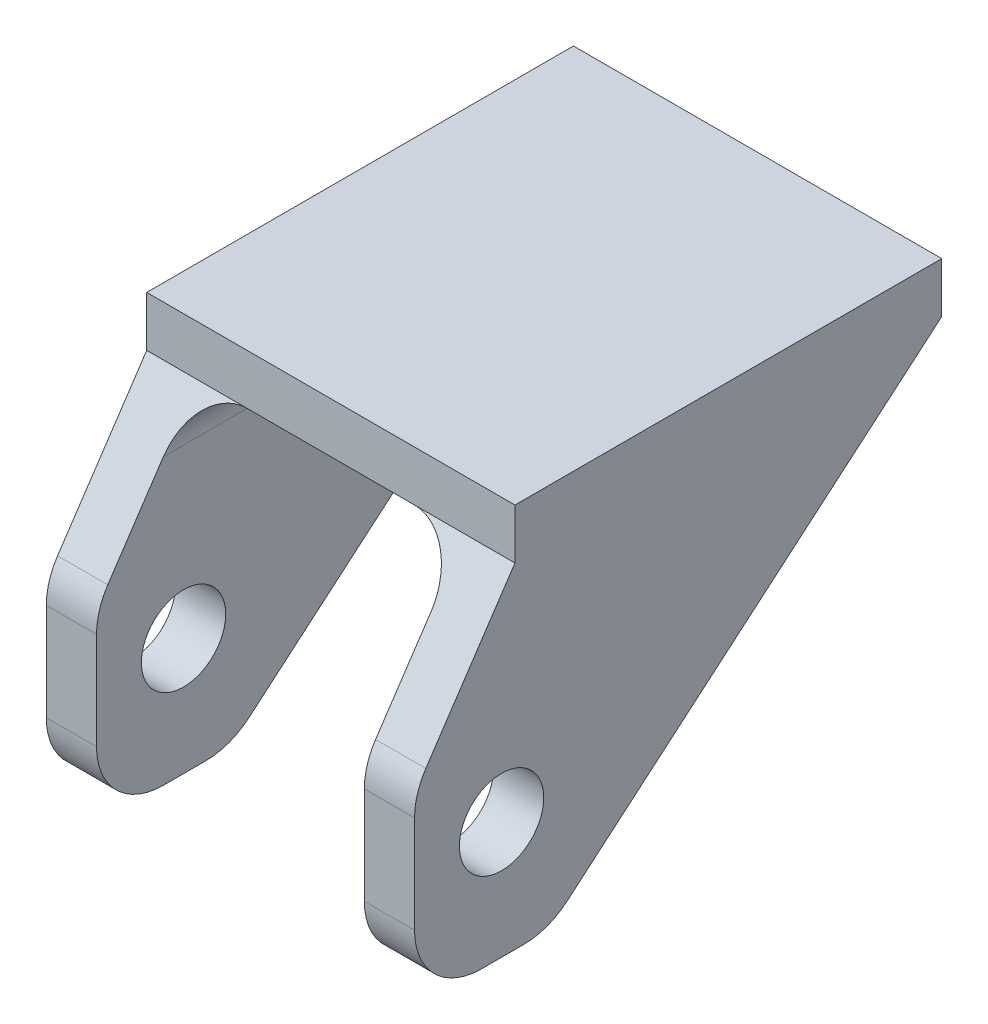
ISO-10303-21;
HEADER;
FILE_DESCRIPTION(('STEP AP214'),'2;1');
FILE_NAME('part.step','',(''),(''),'','','');
FILE_SCHEMA(('AUTOMOTIVE_DESIGN { 1 0 10303 214 1 1 1 1 }'));
ENDSEC;
DATA;
#1=APPLICATION_CONTEXT('core data for automotive mechanical design processes');
#2=APPLICATION_PROTOCOL_DEFINITION('international standard','automotive_design',2000,#1);
#3=PRODUCT_CONTEXT('',#1,'mechanical');
#4=PRODUCT('Part','Part','',(#3));
#5=PRODUCT_RELATED_PRODUCT_CATEGORY('part','',(#4));
#6=PRODUCT_DEFINITION_FORMATION('','',#4);
#7=PRODUCT_DEFINITION_CONTEXT('part definition',#1,'design');
#8=PRODUCT_DEFINITION('design','',#6,#7);
#9=PRODUCT_DEFINITION_SHAPE('','',#8);
#10=(LENGTH_UNIT() NAMED_UNIT(*) SI_UNIT(.MILLI.,.METRE.));
#11=(NAMED_UNIT(*) PLANE_ANGLE_UNIT() SI_UNIT($,.RADIAN.));
#12=(NAMED_UNIT(*) SI_UNIT($,.STERADIAN.) SOLID_ANGLE_UNIT());
#13=UNCERTAINTY_MEASURE_WITH_UNIT(LENGTH_MEASURE(1.E-05),#10,'distance_accuracy_value','');
#14=(GEOMETRIC_REPRESENTATION_CONTEXT(3) GLOBAL_UNCERTAINTY_ASSIGNED_CONTEXT((#13)) GLOBAL_UNIT_ASSIGNED_CONTEXT((#10,
#11,#12)) REPRESENTATION_CONTEXT('',''));
#15=CARTESIAN_POINT('',(0.,0.,0.));
#16=DIRECTION('',(0.,0.,1.));
#17=DIRECTION('',(1.,0.,0.));
#18=AXIS2_PLACEMENT_3D('',#15,#16,#17);
#19=CARTESIAN_POINT('',(0.,4.7625,25.));
#20=DIRECTION('',(0.,0.,1.));
#21=DIRECTION('',(1.,0.,0.));
#22=AXIS2_PLACEMENT_3D('',#19,#20,#21);
#23=PLANE('',#22);
#24=DIRECTION('',(0.,1.,0.));
#25=VECTOR('',#24,1.);
#26=CARTESIAN_POINT('',(-12.7,-31.75,25.));
#27=LINE('',#26,#25);
#28=CARTESIAN_POINT('',(-12.7,-25.4,25.));
#29=VERTEX_POINT('',#28);
#30=CARTESIAN_POINT('',(-12.7,-16.1746990921694,25.));
#31=VERTEX_POINT('',#30);
#32=EDGE_CURVE('E384',#29,#31,#27,.T.);
#33=ORIENTED_EDGE('',*,*,#32,.T.);
#34=DIRECTION('',(1.,0.,0.));
#35=VECTOR('',#34,1.);
#36=CARTESIAN_POINT('',(-17.4625,-16.1746990921694,25.));
#37=LINE('',#36,#35);
#38=CARTESIAN_POINT('',(-17.4625,-16.1746990921694,25.));
#39=VERTEX_POINT('',#38);
#40=EDGE_CURVE('E292',#31,#39,#37,.F.);
#41=ORIENTED_EDGE('',*,*,#40,.T.);
#42=DIRECTION('',(0.,-1.,0.));
#43=VECTOR('',#42,1.);
#44=CARTESIAN_POINT('',(-17.4625,4.7625,25.));
#45=LINE('',#44,#43);
#46=CARTESIAN_POINT('',(-17.4625,-25.4,25.));
#47=VERTEX_POINT('',#46);
#48=EDGE_CURVE('E210',#39,#47,#45,.T.);
#49=ORIENTED_EDGE('',*,*,#48,.T.);
#50=DIRECTION('',(-1.,0.,0.));
#51=VECTOR('',#50,1.);
#52=CARTESIAN_POINT('',(-12.7,-25.4,25.));
#53=LINE('',#52,#51);
#54=EDGE_CURVE('E289',#47,#29,#53,.F.);
#55=ORIENTED_EDGE('',*,*,#54,.T.);
#56=EDGE_LOOP('',(#33,#41,#49,#55));
#57=FACE_BOUND('',#56,.T.);
#58=ADVANCED_FACE('F41',(#57),#23,.T.);
#59=CARTESIAN_POINT('',(0.,0.,0.));
#60=DIRECTION('',(0.,1.,0.));
#61=DIRECTION('',(0.,0.,1.));
#62=AXIS2_PLACEMENT_3D('',#59,#60,#61);
#63=PLANE('',#62);
#64=DIRECTION('',(-1.,0.,0.));
#65=VECTOR('',#64,1.);
#66=CARTESIAN_POINT('',(0.,0.,-25.));
#67=LINE('',#66,#65);
#68=CARTESIAN_POINT('',(7.9375,0.,-25.));
#69=VERTEX_POINT('',#68);
#70=CARTESIAN_POINT('',(-7.9375,0.,-25.));
#71=VERTEX_POINT('',#70);
#72=EDGE_CURVE('E199',#69,#71,#67,.T.);
#73=ORIENTED_EDGE('',*,*,#72,.F.);
#74=DIRECTION('',(0.,0.,-1.));
#75=VECTOR('',#74,1.);
#76=CARTESIAN_POINT('',(7.9375,0.,15.475));
#77=LINE('',#76,#75);
#78=CARTESIAN_POINT('',(7.9375,0.,15.475));
#79=VERTEX_POINT('',#78);
#80=EDGE_CURVE('E314',#69,#79,#77,.F.);
#81=ORIENTED_EDGE('',*,*,#80,.T.);
#82=DIRECTION('',(1.,0.,0.));
#83=VECTOR('',#82,1.);
#84=CARTESIAN_POINT('',(-17.4625,0.,15.475));
#85=LINE('',#84,#83);
#86=CARTESIAN_POINT('',(-7.9375,0.,15.475));
#87=VERTEX_POINT('',#86);
#88=EDGE_CURVE('E758',#87,#79,#85,.T.);
#89=ORIENTED_EDGE('',*,*,#88,.F.);
#90=DIRECTION('',(0.,0.,-1.));
#91=VECTOR('',#90,1.);
#92=CARTESIAN_POINT('',(-7.9375,0.,0.));
#93=LINE('',#92,#91);
#94=EDGE_CURVE('E310',#87,#71,#93,.T.);
#95=ORIENTED_EDGE('',*,*,#94,.T.);
#96=EDGE_LOOP('',(#73,#81,#89,#95));
#97=FACE_BOUND('',#96,.T.);
#98=ADVANCED_FACE('F464',(#97),#63,.F.);
#99=CARTESIAN_POINT('',(0.,4.7625,-25.));
#100=DIRECTION('',(0.,0.,1.));
#101=DIRECTION('',(1.,0.,0.));
#102=AXIS2_PLACEMENT_3D('',#99,#100,#101);
#103=PLANE('',#102);
#104=DIRECTION('',(0.,-1.,0.));
#105=VECTOR('',#104,1.);
#106=CARTESIAN_POINT('',(17.4625,4.7625,-25.));
#107=LINE('',#106,#105);
#108=CARTESIAN_POINT('',(17.4625,4.7625,-25.));
#109=VERTEX_POINT('',#108);
#110=CARTESIAN_POINT('',(17.4625,0.,-25.));
#111=VERTEX_POINT('',#110);
#112=EDGE_CURVE('E397',#109,#111,#107,.T.);
#113=ORIENTED_EDGE('',*,*,#112,.T.);
#114=DIRECTION('',(1.,0.,0.));
#115=VECTOR('',#114,1.);
#116=CARTESIAN_POINT('',(-17.4625,0.,-25.));
#117=LINE('',#116,#115);
#118=EDGE_CURVE('E66',#69,#111,#117,.T.);
#119=ORIENTED_EDGE('',*,*,#118,.F.);
#120=ORIENTED_EDGE('',*,*,#72,.T.);
#121=CARTESIAN_POINT('',(-17.4625,0.,-25.));
#122=VERTEX_POINT('',#121);
#123=EDGE_CURVE('E82',#122,#71,#117,.T.);
#124=ORIENTED_EDGE('',*,*,#123,.F.);
#125=DIRECTION('',(0.,-1.,0.));
#126=VECTOR('',#125,1.);
#127=CARTESIAN_POINT('',(-17.4625,4.7625,-25.));
#128=LINE('',#127,#126);
#129=CARTESIAN_POINT('',(-17.4625,4.7625,-25.));
#130=VERTEX_POINT('',#129);
#131=EDGE_CURVE('E198',#130,#122,#128,.T.);
#132=ORIENTED_EDGE('',*,*,#131,.F.);
#133=DIRECTION('',(-1.,0.,0.));
#134=VECTOR('',#133,1.);
#135=CARTESIAN_POINT('',(0.,4.7625,-25.));
#136=LINE('',#135,#134);
#137=EDGE_CURVE('E388',#109,#130,#136,.T.);
#138=ORIENTED_EDGE('',*,*,#137,.F.);
#139=EDGE_LOOP('',(#113,#119,#120,#124,#132,#138));
#140=FACE_BOUND('',#139,.T.);
#141=ADVANCED_FACE('F196',(#140),#103,.F.);
#142=CARTESIAN_POINT('',(-17.4625,4.7625,0.));
#143=DIRECTION('',(1.,0.,0.));
#144=DIRECTION('',(0.,0.,-1.));
#145=AXIS2_PLACEMENT_3D('',#142,#143,#144);
#146=PLANE('',#145);
#147=CARTESIAN_POINT('',(-17.4625,-20.6375,16.745));
#148=DIRECTION('',(1.,0.,0.));
#149=DIRECTION('',(0.,0.,-1.));
#150=AXIS2_PLACEMENT_3D('',#147,#148,#149);
#151=CIRCLE('',#150,4.);
#152=CARTESIAN_POINT('',(-17.4625,-20.6375,12.745));
#153=VERTEX_POINT('',#152);
#154=EDGE_CURVE('E355',#153,#153,#151,.T.);
#155=ORIENTED_EDGE('',*,*,#154,.T.);
#156=EDGE_LOOP('',(#155));
#157=FACE_BOUND('',#156,.T.);
#158=DIRECTION('',(0.,-0.648181604007245,0.761485789904575));
#159=VECTOR('',#158,1.);
#160=CARTESIAN_POINT('',(-17.4625,-12.3395270182268,-10.5034847943351));
#161=LINE('',#160,#159);
#162=CARTESIAN_POINT('',(-17.4625,-30.2354347658941,10.5206839926881));
#163=VERTEX_POINT('',#162);
#164=EDGE_CURVE('E185',#122,#163,#161,.T.);
#165=ORIENTED_EDGE('',*,*,#164,.T.);
#166=CARTESIAN_POINT('',(-17.4625,-25.4,14.6366371781341));
#167=DIRECTION('',(1.,0.,0.));
#168=DIRECTION('',(0.,0.,-1.));
#169=AXIS2_PLACEMENT_3D('',#166,#167,#168);
#170=CIRCLE('',#169,6.35);
#171=CARTESIAN_POINT('',(-17.4625,-31.75,14.6366371781341));
#172=VERTEX_POINT('',#171);
#173=EDGE_CURVE('E253',#163,#172,#170,.F.);
#174=ORIENTED_EDGE('',*,*,#173,.T.);
#175=DIRECTION('',(0.,0.,1.));
#176=VECTOR('',#175,1.);
#177=CARTESIAN_POINT('',(-17.4625,-31.75,0.));
#178=LINE('',#177,#176);
#179=CARTESIAN_POINT('',(-17.4625,-31.75,18.65));
#180=VERTEX_POINT('',#179);
#181=EDGE_CURVE('E376',#172,#180,#178,.T.);
#182=ORIENTED_EDGE('',*,*,#181,.T.);
#183=CARTESIAN_POINT('',(-17.4625,-25.4,18.65));
#184=DIRECTION('',(1.,0.,0.));
#185=DIRECTION('',(0.,0.,-1.));
#186=AXIS2_PLACEMENT_3D('',#183,#184,#185);
#187=CIRCLE('',#186,6.35);
#188=EDGE_CURVE('E247',#180,#47,#187,.F.);
#189=ORIENTED_EDGE('',*,*,#188,.T.);
#190=ORIENTED_EDGE('',*,*,#48,.F.);
#191=CARTESIAN_POINT('',(-17.4625,-16.1746990921694,18.65));
#192=DIRECTION('',(1.,0.,0.));
#193=DIRECTION('',(0.,0.,-1.));
#194=AXIS2_PLACEMENT_3D('',#191,#192,#193);
#195=CIRCLE('',#194,6.35);
#196=CARTESIAN_POINT('',(-17.4625,-12.6455319689373,23.9289657525218));
#197=VERTEX_POINT('',#196);
#198=EDGE_CURVE('E250',#39,#197,#195,.F.);
#199=ORIENTED_EDGE('',*,*,#198,.T.);
#200=DIRECTION('',(0.,0.831333189373505,-0.555774350115293));
#201=VECTOR('',#200,1.);
#202=CARTESIAN_POINT('',(-17.4625,7.14997093575034,10.695002640392));
#203=LINE('',#202,#201);
#204=CARTESIAN_POINT('',(-17.4625,0.,15.475));
#205=VERTEX_POINT('',#204);
#206=EDGE_CURVE('E424',#197,#205,#203,.T.);
#207=ORIENTED_EDGE('',*,*,#206,.T.);
#208=DIRECTION('',(0.,1.,0.));
#209=VECTOR('',#208,1.);
#210=CARTESIAN_POINT('',(-17.4625,0.,15.475));
#211=LINE('',#210,#209);
#212=CARTESIAN_POINT('',(-17.4625,4.7625,15.475));
#213=VERTEX_POINT('',#212);
#214=EDGE_CURVE('E428',#205,#213,#211,.T.);
#215=ORIENTED_EDGE('',*,*,#214,.T.);
#216=DIRECTION('',(0.,0.,1.));
#217=VECTOR('',#216,1.);
#218=CARTESIAN_POINT('',(-17.4625,4.7625,0.));
#219=LINE('',#218,#217);
#220=EDGE_CURVE('E206',#130,#213,#219,.T.);
#221=ORIENTED_EDGE('',*,*,#220,.F.);
#222=ORIENTED_EDGE('',*,*,#131,.T.);
#223=EDGE_LOOP('',(#165,#174,#182,#189,#190,#199,#207,#215,#221,#222));
#224=FACE_BOUND('',#223,.T.);
#225=ADVANCED_FACE('F203',(#157,#224),#146,.F.);
#226=DIRECTION('',(0.,-1.,0.));
#227=VECTOR('',#226,1.);
#228=CARTESIAN_POINT('',(17.4625,4.7625,25.));
#229=LINE('',#228,#227);
#230=CARTESIAN_POINT('',(17.4625,-16.1746990921694,25.));
#231=VERTEX_POINT('',#230);
#232=CARTESIAN_POINT('',(17.4625,-25.4,25.));
#233=VERTEX_POINT('',#232);
#234=EDGE_CURVE('E218',#231,#233,#229,.T.);
#235=ORIENTED_EDGE('',*,*,#234,.F.);
#236=DIRECTION('',(1.,0.,0.));
#237=VECTOR('',#236,1.);
#238=CARTESIAN_POINT('',(12.7,-16.1746990921694,25.));
#239=LINE('',#238,#237);
#240=CARTESIAN_POINT('',(12.7,-16.1746990921694,25.));
#241=VERTEX_POINT('',#240);
#242=EDGE_CURVE('E303',#231,#241,#239,.F.);
#243=ORIENTED_EDGE('',*,*,#242,.T.);
#244=DIRECTION('',(0.,1.,0.));
#245=VECTOR('',#244,1.);
#246=CARTESIAN_POINT('',(12.7,-31.75,25.));
#247=LINE('',#246,#245);
#248=CARTESIAN_POINT('',(12.7,-25.4,25.));
#249=VERTEX_POINT('',#248);
#250=EDGE_CURVE('E373',#249,#241,#247,.T.);
#251=ORIENTED_EDGE('',*,*,#250,.F.);
#252=DIRECTION('',(1.,0.,0.));
#253=VECTOR('',#252,1.);
#254=CARTESIAN_POINT('',(17.4625,-25.4,25.));
#255=LINE('',#254,#253);
#256=EDGE_CURVE('E299',#249,#233,#255,.T.);
#257=ORIENTED_EDGE('',*,*,#256,.T.);
#258=EDGE_LOOP('',(#235,#243,#251,#257));
#259=FACE_BOUND('',#258,.T.);
#260=ADVANCED_FACE('F411',(#259),#23,.T.);
#261=CARTESIAN_POINT('',(17.4625,4.7625,0.));
#262=DIRECTION('',(1.,0.,0.));
#263=DIRECTION('',(0.,0.,-1.));
#264=AXIS2_PLACEMENT_3D('',#261,#262,#263);
#265=PLANE('',#264);
#266=DIRECTION('',(0.,0.,1.));
#267=VECTOR('',#266,1.);
#268=CARTESIAN_POINT('',(17.4625,-31.75,0.));
#269=LINE('',#268,#267);
#270=CARTESIAN_POINT('',(17.4625,-31.75,14.6366371781341));
#271=VERTEX_POINT('',#270);
#272=CARTESIAN_POINT('',(17.4625,-31.75,18.65));
#273=VERTEX_POINT('',#272);
#274=EDGE_CURVE('E365',#271,#273,#269,.T.);
#275=ORIENTED_EDGE('',*,*,#274,.F.);
#276=CARTESIAN_POINT('',(17.4625,-25.4,14.6366371781341));
#277=DIRECTION('',(1.,0.,0.));
#278=DIRECTION('',(0.,0.,-1.));
#279=AXIS2_PLACEMENT_3D('',#276,#277,#278);
#280=CIRCLE('',#279,6.35);
#281=CARTESIAN_POINT('',(17.4625,-30.2354347658941,10.5206839926881));
#282=VERTEX_POINT('',#281);
#283=EDGE_CURVE('E269',#271,#282,#280,.T.);
#284=ORIENTED_EDGE('',*,*,#283,.T.);
#285=DIRECTION('',(0.,-0.648181604007245,0.761485789904575));
#286=VECTOR('',#285,1.);
#287=CARTESIAN_POINT('',(17.4625,-12.3395270182268,-10.5034847943351));
#288=LINE('',#287,#286);
#289=EDGE_CURVE('E193',#111,#282,#288,.T.);
#290=ORIENTED_EDGE('',*,*,#289,.F.);
#291=ORIENTED_EDGE('',*,*,#112,.F.);
#292=DIRECTION('',(0.,0.,1.));
#293=VECTOR('',#292,1.);
#294=CARTESIAN_POINT('',(17.4625,4.7625,0.));
#295=LINE('',#294,#293);
#296=CARTESIAN_POINT('',(17.4625,4.7625,15.475));
#297=VERTEX_POINT('',#296);
#298=EDGE_CURVE('E393',#109,#297,#295,.T.);
#299=ORIENTED_EDGE('',*,*,#298,.T.);
#300=DIRECTION('',(0.,1.,0.));
#301=VECTOR('',#300,1.);
#302=CARTESIAN_POINT('',(17.4625,0.,15.475));
#303=LINE('',#302,#301);
#304=CARTESIAN_POINT('',(17.4625,0.,15.475));
#305=VERTEX_POINT('',#304);
#306=EDGE_CURVE('E418',#305,#297,#303,.T.);
#307=ORIENTED_EDGE('',*,*,#306,.F.);
#308=DIRECTION('',(0.,0.831333189373505,-0.555774350115293));
#309=VECTOR('',#308,1.);
#310=CARTESIAN_POINT('',(17.4625,7.14997093575034,10.695002640392));
#311=LINE('',#310,#309);
#312=CARTESIAN_POINT('',(17.4625,-12.6455319689373,23.9289657525218));
#313=VERTEX_POINT('',#312);
#314=EDGE_CURVE('E416',#313,#305,#311,.T.);
#315=ORIENTED_EDGE('',*,*,#314,.F.);
#316=CARTESIAN_POINT('',(17.4625,-16.1746990921694,18.65));
#317=DIRECTION('',(1.,0.,0.));
#318=DIRECTION('',(0.,0.,-1.));
#319=AXIS2_PLACEMENT_3D('',#316,#317,#318);
#320=CIRCLE('',#319,6.35);
#321=EDGE_CURVE('E266',#313,#231,#320,.T.);
#322=ORIENTED_EDGE('',*,*,#321,.T.);
#323=ORIENTED_EDGE('',*,*,#234,.T.);
#324=CARTESIAN_POINT('',(17.4625,-25.4,18.65));
#325=DIRECTION('',(1.,0.,0.));
#326=DIRECTION('',(0.,0.,-1.));
#327=AXIS2_PLACEMENT_3D('',#324,#325,#326);
#328=CIRCLE('',#327,6.35);
#329=EDGE_CURVE('E263',#233,#273,#328,.T.);
#330=ORIENTED_EDGE('',*,*,#329,.T.);
#331=EDGE_LOOP('',(#275,#284,#290,#291,#299,#307,#315,#322,#323,#330));
#332=FACE_BOUND('',#331,.T.);
#333=CARTESIAN_POINT('',(17.4625,-20.6375,16.745));
#334=DIRECTION('',(1.,0.,0.));
#335=DIRECTION('',(0.,0.,-1.));
#336=AXIS2_PLACEMENT_3D('',#333,#334,#335);
#337=CIRCLE('',#336,4.);
#338=CARTESIAN_POINT('',(17.4625,-20.6375,12.745));
#339=VERTEX_POINT('',#338);
#340=EDGE_CURVE('E432',#339,#339,#337,.T.);
#341=ORIENTED_EDGE('',*,*,#340,.F.);
#342=EDGE_LOOP('',(#341));
#343=FACE_BOUND('',#342,.T.);
#344=ADVANCED_FACE('F406',(#332,#343),#265,.T.);
#345=CARTESIAN_POINT('',(0.,4.7625,0.));
#346=DIRECTION('',(0.,1.,0.));
#347=DIRECTION('',(0.,0.,1.));
#348=AXIS2_PLACEMENT_3D('',#345,#346,#347);
#349=PLANE('',#348);
#350=DIRECTION('',(1.,0.,0.));
#351=VECTOR('',#350,1.);
#352=CARTESIAN_POINT('',(-17.4625,4.7625,15.475));
#353=LINE('',#352,#351);
#354=EDGE_CURVE('E435',#213,#297,#353,.T.);
#355=ORIENTED_EDGE('',*,*,#354,.T.);
#356=ORIENTED_EDGE('',*,*,#298,.F.);
#357=ORIENTED_EDGE('',*,*,#137,.T.);
#358=ORIENTED_EDGE('',*,*,#220,.T.);
#359=EDGE_LOOP('',(#355,#356,#357,#358));
#360=FACE_BOUND('',#359,.T.);
#361=ADVANCED_FACE('F479',(#360),#349,.T.);
#362=CARTESIAN_POINT('',(-12.7,-31.75,0.));
#363=DIRECTION('',(1.,0.,0.));
#364=DIRECTION('',(0.,0.,-1.));
#365=AXIS2_PLACEMENT_3D('',#362,#363,#364);
#366=PLANE('',#365);
#367=DIRECTION('',(0.,-0.648181604007245,0.761485789904575));
#368=VECTOR('',#367,1.);
#369=CARTESIAN_POINT('',(-12.7,-25.6789527070324,5.16771451881289));
#370=LINE('',#369,#368);
#371=CARTESIAN_POINT('',(-12.7,-4.76249999999999,-19.405));
#372=VERTEX_POINT('',#371);
#373=CARTESIAN_POINT('',(-12.7,-30.235434765894,10.5206839926881));
#374=VERTEX_POINT('',#373);
#375=EDGE_CURVE('E226',#372,#374,#370,.T.);
#376=ORIENTED_EDGE('',*,*,#375,.F.);
#377=DIRECTION('',(0.,0.,-1.));
#378=VECTOR('',#377,1.);
#379=CARTESIAN_POINT('',(-12.7,-4.7625,0.));
#380=LINE('',#379,#378);
#381=CARTESIAN_POINT('',(-12.7,-4.7625,18.6588923024579));
#382=VERTEX_POINT('',#381);
#383=EDGE_CURVE('E318',#372,#382,#380,.F.);
#384=ORIENTED_EDGE('',*,*,#383,.T.);
#385=DIRECTION('',(0.,0.831333189373505,-0.555774350115293));
#386=VECTOR('',#385,1.);
#387=CARTESIAN_POINT('',(-12.7,-14.7929262424368,25.3645714423353));
#388=LINE('',#387,#386);
#389=CARTESIAN_POINT('',(-12.7,-12.6455319689373,23.9289657525218));
#390=VERTEX_POINT('',#389);
#391=EDGE_CURVE('E361',#390,#382,#388,.T.);
#392=ORIENTED_EDGE('',*,*,#391,.F.);
#393=CARTESIAN_POINT('',(-12.7,-16.1746990921694,18.65));
#394=DIRECTION('',(1.,0.,0.));
#395=DIRECTION('',(0.,0.,-1.));
#396=AXIS2_PLACEMENT_3D('',#393,#394,#395);
#397=CIRCLE('',#396,6.35);
#398=EDGE_CURVE('E238',#390,#31,#397,.T.);
#399=ORIENTED_EDGE('',*,*,#398,.T.);
#400=ORIENTED_EDGE('',*,*,#32,.F.);
#401=CARTESIAN_POINT('',(-12.7,-25.4,18.65));
#402=DIRECTION('',(1.,0.,0.));
#403=DIRECTION('',(0.,0.,-1.));
#404=AXIS2_PLACEMENT_3D('',#401,#402,#403);
#405=CIRCLE('',#404,6.35);
#406=CARTESIAN_POINT('',(-12.7,-31.75,18.65));
#407=VERTEX_POINT('',#406);
#408=EDGE_CURVE('E235',#29,#407,#405,.T.);
#409=ORIENTED_EDGE('',*,*,#408,.T.);
#410=DIRECTION('',(0.,0.,-1.));
#411=VECTOR('',#410,1.);
#412=CARTESIAN_POINT('',(-12.7,-31.75,0.));
#413=LINE('',#412,#411);
#414=CARTESIAN_POINT('',(-12.7,-31.75,14.6366371781341));
#415=VERTEX_POINT('',#414);
#416=EDGE_CURVE('E380',#407,#415,#413,.T.);
#417=ORIENTED_EDGE('',*,*,#416,.T.);
#418=CARTESIAN_POINT('',(-12.7,-25.4,14.6366371781341));
#419=DIRECTION('',(1.,0.,0.));
#420=DIRECTION('',(0.,0.,-1.));
#421=AXIS2_PLACEMENT_3D('',#418,#419,#420);
#422=CIRCLE('',#421,6.35);
#423=EDGE_CURVE('E241',#415,#374,#422,.T.);
#424=ORIENTED_EDGE('',*,*,#423,.T.);
#425=EDGE_LOOP('',(#376,#384,#392,#399,#400,#409,#417,#424));
#426=FACE_BOUND('',#425,.T.);
#427=CARTESIAN_POINT('',(-12.7,-20.6375,16.745));
#428=DIRECTION('',(1.,0.,0.));
#429=DIRECTION('',(0.,0.,-1.));
#430=AXIS2_PLACEMENT_3D('',#427,#428,#429);
#431=CIRCLE('',#430,4.);
#432=CARTESIAN_POINT('',(-12.7,-20.6375,12.745));
#433=VERTEX_POINT('',#432);
#434=EDGE_CURVE('E225',#433,#433,#431,.T.);
#435=ORIENTED_EDGE('',*,*,#434,.F.);
#436=EDGE_LOOP('',(#435));
#437=FACE_BOUND('',#436,.T.);
#438=ADVANCED_FACE('F517',(#426,#437),#366,.T.);
#439=CARTESIAN_POINT('',(0.,-31.75,0.));
#440=DIRECTION('',(0.,1.,0.));
#441=DIRECTION('',(0.,0.,1.));
#442=AXIS2_PLACEMENT_3D('',#439,#440,#441);
#443=PLANE('',#442);
#444=ORIENTED_EDGE('',*,*,#181,.F.);
#445=DIRECTION('',(1.,0.,0.));
#446=VECTOR('',#445,1.);
#447=CARTESIAN_POINT('',(0.,-31.75,14.6366371781341));
#448=LINE('',#447,#446);
#449=EDGE_CURVE('E231',#172,#415,#448,.T.);
#450=ORIENTED_EDGE('',*,*,#449,.T.);
#451=ORIENTED_EDGE('',*,*,#416,.F.);
#452=DIRECTION('',(-1.,0.,0.));
#453=VECTOR('',#452,1.);
#454=CARTESIAN_POINT('',(-17.4625,-31.75,18.65));
#455=LINE('',#454,#453);
#456=EDGE_CURVE('E215',#407,#180,#455,.T.);
#457=ORIENTED_EDGE('',*,*,#456,.T.);
#458=EDGE_LOOP('',(#444,#450,#451,#457));
#459=FACE_BOUND('',#458,.T.);
#460=ADVANCED_FACE('F524',(#459),#443,.F.);
#461=CARTESIAN_POINT('',(12.7,-31.75,0.));
#462=DIRECTION('',(1.,0.,0.));
#463=DIRECTION('',(0.,0.,-1.));
#464=AXIS2_PLACEMENT_3D('',#461,#462,#463);
#465=PLANE('',#464);
#466=CARTESIAN_POINT('',(12.7,-20.6375,16.745));
#467=DIRECTION('',(1.,0.,0.));
#468=DIRECTION('',(0.,0.,-1.));
#469=AXIS2_PLACEMENT_3D('',#466,#467,#468);
#470=CIRCLE('',#469,4.);
#471=CARTESIAN_POINT('',(12.7,-20.6375,12.745));
#472=VERTEX_POINT('',#471);
#473=EDGE_CURVE('E222',#472,#472,#470,.T.);
#474=ORIENTED_EDGE('',*,*,#473,.T.);
#475=EDGE_LOOP('',(#474));
#476=FACE_BOUND('',#475,.T.);
#477=DIRECTION('',(0.,0.831333189373505,-0.555774350115293));
#478=VECTOR('',#477,1.);
#479=CARTESIAN_POINT('',(12.7,-14.7929262424368,25.3645714423353));
#480=LINE('',#479,#478);
#481=CARTESIAN_POINT('',(12.7,-12.6455319689373,23.9289657525218));
#482=VERTEX_POINT('',#481);
#483=CARTESIAN_POINT('',(12.7,-4.7625,18.6588923024579));
#484=VERTEX_POINT('',#483);
#485=EDGE_CURVE('E209',#482,#484,#480,.T.);
#486=ORIENTED_EDGE('',*,*,#485,.T.);
#487=DIRECTION('',(0.,0.,-1.));
#488=VECTOR('',#487,1.);
#489=CARTESIAN_POINT('',(12.7,-4.7625,-25.));
#490=LINE('',#489,#488);
#491=CARTESIAN_POINT('',(12.7,-4.76249999999999,-19.405));
#492=VERTEX_POINT('',#491);
#493=EDGE_CURVE('E306',#484,#492,#490,.T.);
#494=ORIENTED_EDGE('',*,*,#493,.T.);
#495=DIRECTION('',(0.,-0.648181604007245,0.761485789904575));
#496=VECTOR('',#495,1.);
#497=CARTESIAN_POINT('',(12.7,-25.6789527070324,5.16771451881289));
#498=LINE('',#497,#496);
#499=CARTESIAN_POINT('',(12.7,-30.235434765894,10.5206839926881));
#500=VERTEX_POINT('',#499);
#501=EDGE_CURVE('E201',#492,#500,#498,.T.);
#502=ORIENTED_EDGE('',*,*,#501,.T.);
#503=CARTESIAN_POINT('',(12.7,-25.4,14.6366371781341));
#504=DIRECTION('',(1.,0.,0.));
#505=DIRECTION('',(0.,0.,-1.));
#506=AXIS2_PLACEMENT_3D('',#503,#504,#505);
#507=CIRCLE('',#506,6.35);
#508=CARTESIAN_POINT('',(12.7,-31.75,14.6366371781341));
#509=VERTEX_POINT('',#508);
#510=EDGE_CURVE('E282',#500,#509,#507,.F.);
#511=ORIENTED_EDGE('',*,*,#510,.T.);
#512=DIRECTION('',(0.,0.,-1.));
#513=VECTOR('',#512,1.);
#514=CARTESIAN_POINT('',(12.7,-31.75,0.));
#515=LINE('',#514,#513);
#516=CARTESIAN_POINT('',(12.7,-31.75,18.65));
#517=VERTEX_POINT('',#516);
#518=EDGE_CURVE('E369',#517,#509,#515,.T.);
#519=ORIENTED_EDGE('',*,*,#518,.F.);
#520=CARTESIAN_POINT('',(12.7,-25.4,18.65));
#521=DIRECTION('',(1.,0.,0.));
#522=DIRECTION('',(0.,0.,-1.));
#523=AXIS2_PLACEMENT_3D('',#520,#521,#522);
#524=CIRCLE('',#523,6.35);
#525=EDGE_CURVE('E276',#517,#249,#524,.F.);
#526=ORIENTED_EDGE('',*,*,#525,.T.);
#527=ORIENTED_EDGE('',*,*,#250,.T.);
#528=CARTESIAN_POINT('',(12.7,-16.1746990921694,18.65));
#529=DIRECTION('',(1.,0.,0.));
#530=DIRECTION('',(0.,0.,-1.));
#531=AXIS2_PLACEMENT_3D('',#528,#529,#530);
#532=CIRCLE('',#531,6.35);
#533=EDGE_CURVE('E279',#241,#482,#532,.F.);
#534=ORIENTED_EDGE('',*,*,#533,.T.);
#535=EDGE_LOOP('',(#486,#494,#502,#511,#519,#526,#527,#534));
#536=FACE_BOUND('',#535,.T.);
#537=ADVANCED_FACE('F339',(#476,#536),#465,.F.);
#538=CARTESIAN_POINT('',(0.,-31.75,0.));
#539=DIRECTION('',(0.,1.,0.));
#540=DIRECTION('',(0.,0.,1.));
#541=AXIS2_PLACEMENT_3D('',#538,#539,#540);
#542=PLANE('',#541);
#543=ORIENTED_EDGE('',*,*,#518,.T.);
#544=DIRECTION('',(1.,0.,0.));
#545=VECTOR('',#544,1.);
#546=CARTESIAN_POINT('',(0.,-31.75,14.6366371781341));
#547=LINE('',#546,#545);
#548=EDGE_CURVE('E259',#509,#271,#547,.T.);
#549=ORIENTED_EDGE('',*,*,#548,.T.);
#550=ORIENTED_EDGE('',*,*,#274,.T.);
#551=DIRECTION('',(1.,0.,0.));
#552=VECTOR('',#551,1.);
#553=CARTESIAN_POINT('',(12.7,-31.75,18.65));
#554=LINE('',#553,#552);
#555=EDGE_CURVE('E256',#273,#517,#554,.F.);
#556=ORIENTED_EDGE('',*,*,#555,.T.);
#557=EDGE_LOOP('',(#543,#549,#550,#556));
#558=FACE_BOUND('',#557,.T.);
#559=ADVANCED_FACE('F537',(#558),#542,.F.);
#560=CARTESIAN_POINT('',(-17.4625,-12.3395270182268,-10.5034847943351));
#561=DIRECTION('',(0.,0.761485789904575,0.648181604007245));
#562=DIRECTION('',(0.,-0.648181604007245,0.761485789904575));
#563=AXIS2_PLACEMENT_3D('',#560,#561,#562);
#564=PLANE('',#563);
#565=ORIENTED_EDGE('',*,*,#289,.T.);
#566=DIRECTION('',(1.,0.,0.));
#567=VECTOR('',#566,1.);
#568=CARTESIAN_POINT('',(-17.4625,-30.2354347658941,10.5206839926881));
#569=LINE('',#568,#567);
#570=EDGE_CURVE('E272',#282,#500,#569,.F.);
#571=ORIENTED_EDGE('',*,*,#570,.T.);
#572=ORIENTED_EDGE('',*,*,#501,.F.);
#573=CARTESIAN_POINT('',(7.9375,-4.7625,-19.405));
#574=DIRECTION('',(0.,0.761485789904575,0.648181604007245));
#575=DIRECTION('',(0.,-0.648181604007245,0.761485789904575));
#576=AXIS2_PLACEMENT_3D('',#573,#574,#575);
#577=ELLIPSE('',#576,7.3474778836006,4.7625);
#578=EDGE_CURVE('E321',#492,#69,#577,.T.);
#579=ORIENTED_EDGE('',*,*,#578,.T.);
#580=ORIENTED_EDGE('',*,*,#118,.T.);
#581=EDGE_LOOP('',(#565,#571,#572,#579,#580));
#582=FACE_BOUND('',#581,.T.);
#583=ADVANCED_FACE('F346',(#582),#564,.F.);
#584=CARTESIAN_POINT('',(-17.4625,-20.6375,16.745));
#585=DIRECTION('',(1.,0.,0.));
#586=DIRECTION('',(0.,0.,-1.));
#587=AXIS2_PLACEMENT_3D('',#584,#585,#586);
#588=CYLINDRICAL_SURFACE('',#587,4.);
#589=ORIENTED_EDGE('',*,*,#340,.T.);
#590=EDGE_LOOP('',(#589));
#591=FACE_BOUND('',#590,.T.);
#592=ORIENTED_EDGE('',*,*,#473,.F.);
#593=EDGE_LOOP('',(#592));
#594=FACE_BOUND('',#593,.T.);
#595=ADVANCED_FACE('F450',(#591,#594),#588,.F.);
#596=CARTESIAN_POINT('',(-17.4625,7.14997093575034,10.695002640392));
#597=DIRECTION('',(0.,-0.555774350115293,-0.831333189373505));
#598=DIRECTION('',(0.,0.831333189373505,-0.555774350115293));
#599=AXIS2_PLACEMENT_3D('',#596,#597,#598);
#600=PLANE('',#599);
#601=ORIENTED_EDGE('',*,*,#485,.F.);
#602=DIRECTION('',(1.,0.,0.));
#603=VECTOR('',#602,1.);
#604=CARTESIAN_POINT('',(17.4625,-12.6455319689373,23.9289657525218));
#605=LINE('',#604,#603);
#606=EDGE_CURVE('E295',#482,#313,#605,.T.);
#607=ORIENTED_EDGE('',*,*,#606,.T.);
#608=ORIENTED_EDGE('',*,*,#314,.T.);
#609=EDGE_CURVE('E334',#79,#305,#85,.T.);
#610=ORIENTED_EDGE('',*,*,#609,.F.);
#611=CARTESIAN_POINT('',(7.9375,-4.7625,18.6588923024579));
#612=DIRECTION('',(0.,-0.555774350115293,-0.831333189373505));
#613=DIRECTION('',(0.,-0.831333189373505,0.555774350115293));
#614=AXIS2_PLACEMENT_3D('',#611,#612,#613);
#615=ELLIPSE('',#614,5.72874998962694,4.7625);
#616=EDGE_CURVE('E325',#79,#484,#615,.T.);
#617=ORIENTED_EDGE('',*,*,#616,.T.);
#618=EDGE_LOOP('',(#601,#607,#608,#610,#617));
#619=FACE_BOUND('',#618,.T.);
#620=ADVANCED_FACE('F331',(#619),#600,.F.);
#621=ORIENTED_EDGE('',*,*,#206,.F.);
#622=DIRECTION('',(1.,0.,0.));
#623=VECTOR('',#622,1.);
#624=CARTESIAN_POINT('',(-12.7,-12.6455319689373,23.9289657525218));
#625=LINE('',#624,#623);
#626=EDGE_CURVE('E285',#197,#390,#625,.T.);
#627=ORIENTED_EDGE('',*,*,#626,.T.);
#628=ORIENTED_EDGE('',*,*,#391,.T.);
#629=CARTESIAN_POINT('',(-7.9375,-4.7625,18.6588923024579));
#630=DIRECTION('',(0.,-0.555774350115293,-0.831333189373505));
#631=DIRECTION('',(0.,0.831333189373505,-0.555774350115293));
#632=AXIS2_PLACEMENT_3D('',#629,#630,#631);
#633=ELLIPSE('',#632,5.72874998962694,4.7625);
#634=EDGE_CURVE('E11',#382,#87,#633,.T.);
#635=ORIENTED_EDGE('',*,*,#634,.T.);
#636=EDGE_CURVE('E57',#205,#87,#85,.T.);
#637=ORIENTED_EDGE('',*,*,#636,.F.);
#638=EDGE_LOOP('',(#621,#627,#628,#635,#637));
#639=FACE_BOUND('',#638,.T.);
#640=ADVANCED_FACE('F513',(#639),#600,.F.);
#641=CARTESIAN_POINT('',(-17.4625,0.,15.475));
#642=DIRECTION('',(0.,0.,-1.));
#643=DIRECTION('',(-1.,0.,0.));
#644=AXIS2_PLACEMENT_3D('',#641,#642,#643);
#645=PLANE('',#644);
#646=ORIENTED_EDGE('',*,*,#306,.T.);
#647=ORIENTED_EDGE('',*,*,#354,.F.);
#648=ORIENTED_EDGE('',*,*,#214,.F.);
#649=ORIENTED_EDGE('',*,*,#636,.T.);
#650=ORIENTED_EDGE('',*,*,#88,.T.);
#651=ORIENTED_EDGE('',*,*,#609,.T.);
#652=EDGE_LOOP('',(#646,#647,#648,#649,#650,#651));
#653=FACE_BOUND('',#652,.T.);
#654=ADVANCED_FACE('F458',(#653),#645,.F.);
#655=ORIENTED_EDGE('',*,*,#123,.T.);
#656=CARTESIAN_POINT('',(-7.9375,-4.7625,-19.405));
#657=DIRECTION('',(0.,0.761485789904575,0.648181604007245));
#658=DIRECTION('',(0.,0.648181604007245,-0.761485789904575));
#659=AXIS2_PLACEMENT_3D('',#656,#657,#658);
#660=ELLIPSE('',#659,7.3474778836006,4.7625);
#661=EDGE_CURVE('E50',#71,#372,#660,.T.);
#662=ORIENTED_EDGE('',*,*,#661,.T.);
#663=ORIENTED_EDGE('',*,*,#375,.T.);
#664=DIRECTION('',(1.,0.,0.));
#665=VECTOR('',#664,1.);
#666=CARTESIAN_POINT('',(-17.4625,-30.2354347658941,10.5206839926881));
#667=LINE('',#666,#665);
#668=EDGE_CURVE('E188',#374,#163,#667,.F.);
#669=ORIENTED_EDGE('',*,*,#668,.T.);
#670=ORIENTED_EDGE('',*,*,#164,.F.);
#671=EDGE_LOOP('',(#655,#662,#663,#669,#670));
#672=FACE_BOUND('',#671,.T.);
#673=ADVANCED_FACE('F186',(#672),#564,.F.);
#674=ORIENTED_EDGE('',*,*,#434,.T.);
#675=EDGE_LOOP('',(#674));
#676=FACE_BOUND('',#675,.T.);
#677=ORIENTED_EDGE('',*,*,#154,.F.);
#678=EDGE_LOOP('',(#677));
#679=FACE_BOUND('',#678,.T.);
#680=ADVANCED_FACE('F445',(#676,#679),#588,.F.);
#681=CARTESIAN_POINT('',(0.,-25.4,14.6366371781341));
#682=DIRECTION('',(1.,0.,0.));
#683=DIRECTION('',(0.,0.,-1.));
#684=AXIS2_PLACEMENT_3D('',#681,#682,#683);
#685=CYLINDRICAL_SURFACE('',#684,6.35);
#686=ORIENTED_EDGE('',*,*,#173,.F.);
#687=ORIENTED_EDGE('',*,*,#668,.F.);
#688=ORIENTED_EDGE('',*,*,#423,.F.);
#689=ORIENTED_EDGE('',*,*,#449,.F.);
#690=EDGE_LOOP('',(#686,#687,#688,#689));
#691=FACE_BOUND('',#690,.T.);
#692=ADVANCED_FACE('F447',(#691),#685,.T.);
#693=CARTESIAN_POINT('',(0.,-25.4,14.6366371781341));
#694=DIRECTION('',(1.,0.,0.));
#695=DIRECTION('',(0.,0.,-1.));
#696=AXIS2_PLACEMENT_3D('',#693,#694,#695);
#697=CYLINDRICAL_SURFACE('',#696,6.35);
#698=ORIENTED_EDGE('',*,*,#510,.F.);
#699=ORIENTED_EDGE('',*,*,#570,.F.);
#700=ORIENTED_EDGE('',*,*,#283,.F.);
#701=ORIENTED_EDGE('',*,*,#548,.F.);
#702=EDGE_LOOP('',(#698,#699,#700,#701));
#703=FACE_BOUND('',#702,.T.);
#704=ADVANCED_FACE('F455',(#703),#697,.T.);
#705=CARTESIAN_POINT('',(-17.4625,-16.1746990921694,18.65));
#706=DIRECTION('',(-1.,0.,0.));
#707=DIRECTION('',(0.,-1.,0.));
#708=AXIS2_PLACEMENT_3D('',#705,#706,#707);
#709=CYLINDRICAL_SURFACE('',#708,6.35);
#710=ORIENTED_EDGE('',*,*,#198,.F.);
#711=ORIENTED_EDGE('',*,*,#40,.F.);
#712=ORIENTED_EDGE('',*,*,#398,.F.);
#713=ORIENTED_EDGE('',*,*,#626,.F.);
#714=EDGE_LOOP('',(#710,#711,#712,#713));
#715=FACE_BOUND('',#714,.T.);
#716=ADVANCED_FACE('F487',(#715),#709,.T.);
#717=CARTESIAN_POINT('',(-17.4625,-16.1746990921694,18.65));
#718=DIRECTION('',(-1.,0.,0.));
#719=DIRECTION('',(0.,-1.,0.));
#720=AXIS2_PLACEMENT_3D('',#717,#718,#719);
#721=CYLINDRICAL_SURFACE('',#720,6.35);
#722=ORIENTED_EDGE('',*,*,#533,.F.);
#723=ORIENTED_EDGE('',*,*,#242,.F.);
#724=ORIENTED_EDGE('',*,*,#321,.F.);
#725=ORIENTED_EDGE('',*,*,#606,.F.);
#726=EDGE_LOOP('',(#722,#723,#724,#725));
#727=FACE_BOUND('',#726,.T.);
#728=ADVANCED_FACE('F415',(#727),#721,.T.);
#729=CARTESIAN_POINT('',(0.,-25.4,18.65));
#730=DIRECTION('',(1.,0.,0.));
#731=DIRECTION('',(0.,0.,-1.));
#732=AXIS2_PLACEMENT_3D('',#729,#730,#731);
#733=CYLINDRICAL_SURFACE('',#732,6.35);
#734=ORIENTED_EDGE('',*,*,#408,.F.);
#735=ORIENTED_EDGE('',*,*,#54,.F.);
#736=ORIENTED_EDGE('',*,*,#188,.F.);
#737=ORIENTED_EDGE('',*,*,#456,.F.);
#738=EDGE_LOOP('',(#734,#735,#736,#737));
#739=FACE_BOUND('',#738,.T.);
#740=ADVANCED_FACE('F494',(#739),#733,.T.);
#741=CARTESIAN_POINT('',(0.,-25.4,18.65));
#742=DIRECTION('',(-1.,0.,0.));
#743=DIRECTION('',(0.,0.,1.));
#744=AXIS2_PLACEMENT_3D('',#741,#742,#743);
#745=CYLINDRICAL_SURFACE('',#744,6.35);
#746=ORIENTED_EDGE('',*,*,#525,.F.);
#747=ORIENTED_EDGE('',*,*,#555,.F.);
#748=ORIENTED_EDGE('',*,*,#329,.F.);
#749=ORIENTED_EDGE('',*,*,#256,.F.);
#750=EDGE_LOOP('',(#746,#747,#748,#749));
#751=FACE_BOUND('',#750,.T.);
#752=ADVANCED_FACE('F497',(#751),#745,.T.);
#753=CARTESIAN_POINT('',(7.9375,-4.7625,0.));
#754=DIRECTION('',(0.,0.,1.));
#755=DIRECTION('',(1.,0.,0.));
#756=AXIS2_PLACEMENT_3D('',#753,#754,#755);
#757=CYLINDRICAL_SURFACE('',#756,4.7625);
#758=ORIENTED_EDGE('',*,*,#616,.F.);
#759=ORIENTED_EDGE('',*,*,#80,.F.);
#760=ORIENTED_EDGE('',*,*,#578,.F.);
#761=ORIENTED_EDGE('',*,*,#493,.F.);
#762=EDGE_LOOP('',(#758,#759,#760,#761));
#763=FACE_BOUND('',#762,.T.);
#764=ADVANCED_FACE('F343',(#763),#757,.F.);
#765=CARTESIAN_POINT('',(-7.9375,-4.7625,0.));
#766=DIRECTION('',(0.,0.,-1.));
#767=DIRECTION('',(-1.,0.,0.));
#768=AXIS2_PLACEMENT_3D('',#765,#766,#767);
#769=CYLINDRICAL_SURFACE('',#768,4.7625);
#770=ORIENTED_EDGE('',*,*,#634,.F.);
#771=ORIENTED_EDGE('',*,*,#383,.F.);
#772=ORIENTED_EDGE('',*,*,#661,.F.);
#773=ORIENTED_EDGE('',*,*,#94,.F.);
#774=EDGE_LOOP('',(#770,#771,#772,#773));
#775=FACE_BOUND('',#774,.T.);
#776=ADVANCED_FACE('F43',(#775),#769,.F.);
#777=CLOSED_SHELL('',(#58,#98,#141,#225,#260,#344,#361,#438,#460,#537,#559,#583,#595,#620,#640,
#654,#673,#680,#692,#704,#716,#728,#740,#752,#764,#776));
#778=MANIFOLD_SOLID_BREP('B2',#777);
#779=ADVANCED_BREP_SHAPE_REPRESENTATION('',(#18,#778),#14);
#780=SHAPE_DEFINITION_REPRESENTATION(#9,#779);
ENDSEC;
END-ISO-10303-21;
